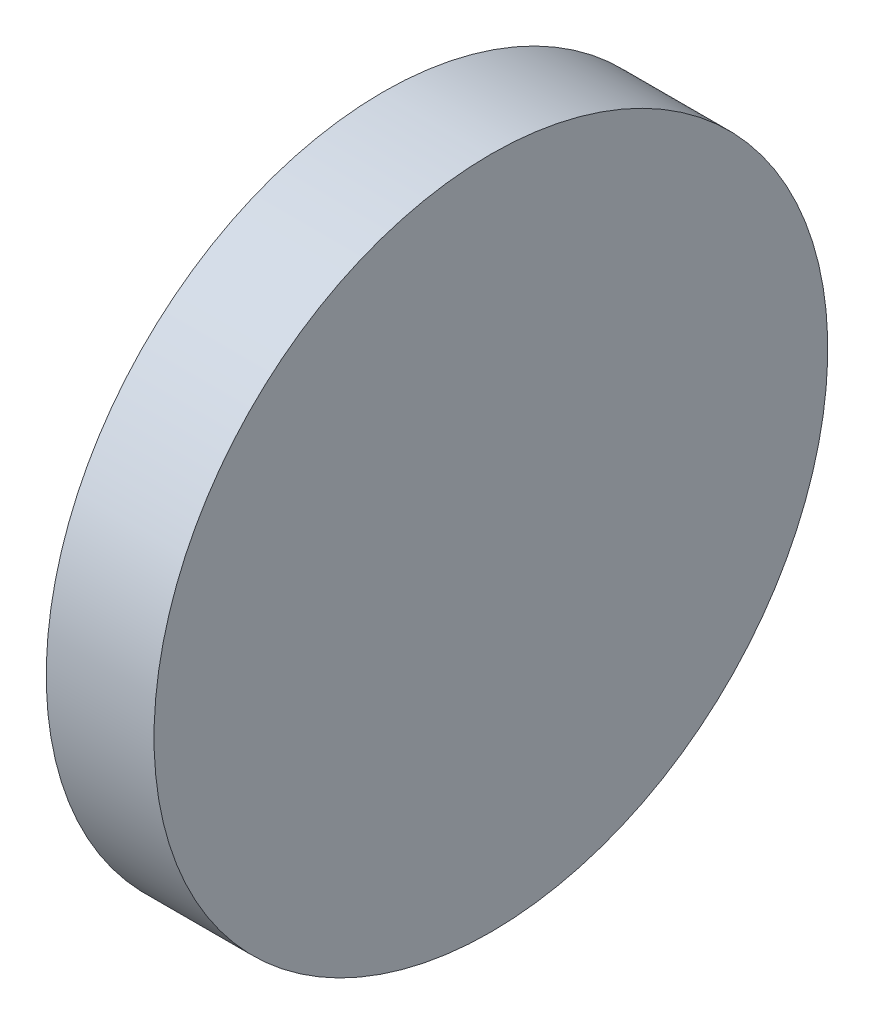
ISO-10303-21;
HEADER;
FILE_DESCRIPTION(('STEP AP214'),'2;1');
FILE_NAME('part.step','',(''),(''),'','','');
FILE_SCHEMA(('AUTOMOTIVE_DESIGN { 1 0 10303 214 1 1 1 1 }'));
ENDSEC;
DATA;
#1=APPLICATION_CONTEXT('core data for automotive mechanical design processes');
#2=APPLICATION_PROTOCOL_DEFINITION('international standard','automotive_design',2000,#1);
#3=PRODUCT_CONTEXT('',#1,'mechanical');
#4=PRODUCT('Part','Part','',(#3));
#5=PRODUCT_RELATED_PRODUCT_CATEGORY('part','',(#4));
#6=PRODUCT_DEFINITION_FORMATION('','',#4);
#7=PRODUCT_DEFINITION_CONTEXT('part definition',#1,'design');
#8=PRODUCT_DEFINITION('design','',#6,#7);
#9=PRODUCT_DEFINITION_SHAPE('','',#8);
#10=(LENGTH_UNIT() NAMED_UNIT(*) SI_UNIT(.MILLI.,.METRE.));
#11=(NAMED_UNIT(*) PLANE_ANGLE_UNIT() SI_UNIT($,.RADIAN.));
#12=(NAMED_UNIT(*) SI_UNIT($,.STERADIAN.) SOLID_ANGLE_UNIT());
#13=UNCERTAINTY_MEASURE_WITH_UNIT(LENGTH_MEASURE(1.E-05),#10,'distance_accuracy_value','');
#14=(GEOMETRIC_REPRESENTATION_CONTEXT(3) GLOBAL_UNCERTAINTY_ASSIGNED_CONTEXT((#13)) GLOBAL_UNIT_ASSIGNED_CONTEXT((#10,
#11,#12)) REPRESENTATION_CONTEXT('',''));
#15=CARTESIAN_POINT('',(0.,0.,0.));
#16=DIRECTION('',(0.,0.,1.));
#17=DIRECTION('',(1.,0.,0.));
#18=AXIS2_PLACEMENT_3D('',#15,#16,#17);
#19=CARTESIAN_POINT('',(1.05963571469062,-0.332340218761648,0.1012));
#20=DIRECTION('',(-1.,0.,0.));
#21=DIRECTION('',(0.,-1.,0.));
#22=AXIS2_PLACEMENT_3D('',#19,#20,#21);
#23=PLANE('',#22);
#24=CARTESIAN_POINT('',(1.05963571469062,-0.332340218761648,0.1012));
#25=DIRECTION('',(1.,0.,0.));
#26=DIRECTION('',(0.,1.,0.));
#27=AXIS2_PLACEMENT_3D('',#24,#25,#26);
#28=CIRCLE('',#27,0.03125);
#29=CARTESIAN_POINT('',(1.05963571469062,-0.301090218761648,0.1012));
#30=VERTEX_POINT('',#29);
#31=EDGE_CURVE('E18',#30,#30,#28,.F.);
#32=ORIENTED_EDGE('',*,*,#31,.F.);
#33=EDGE_LOOP('',(#32));
#34=FACE_BOUND('',#33,.T.);
#35=ADVANCED_FACE('F15',(#34),#23,.F.);
#36=CARTESIAN_POINT('',(1.07963571469062,-0.332340218761648,0.1012));
#37=DIRECTION('',(1.,0.,0.));
#38=DIRECTION('',(0.,1.,0.));
#39=AXIS2_PLACEMENT_3D('',#36,#37,#38);
#40=CYLINDRICAL_SURFACE('',#39,0.03125);
#41=CARTESIAN_POINT('',(1.04963571469062,-0.332340218761648,0.1012));
#42=DIRECTION('',(1.,0.,0.));
#43=DIRECTION('',(0.,1.,0.));
#44=AXIS2_PLACEMENT_3D('',#41,#42,#43);
#45=CIRCLE('',#44,0.03125);
#46=CARTESIAN_POINT('',(1.04963571469062,-0.301090218761648,0.1012));
#47=VERTEX_POINT('',#46);
#48=EDGE_CURVE('E10',#47,#47,#45,.T.);
#49=ORIENTED_EDGE('',*,*,#48,.T.);
#50=EDGE_LOOP('',(#49));
#51=FACE_BOUND('',#50,.T.);
#52=ORIENTED_EDGE('',*,*,#31,.T.);
#53=EDGE_LOOP('',(#52));
#54=FACE_BOUND('',#53,.T.);
#55=ADVANCED_FACE('F27',(#51,#54),#40,.T.);
#56=CARTESIAN_POINT('',(1.04963571469062,-0.332340218761648,0.1012));
#57=DIRECTION('',(1.,0.,0.));
#58=DIRECTION('',(0.,1.,0.));
#59=AXIS2_PLACEMENT_3D('',#56,#57,#58);
#60=PLANE('',#59);
#61=ORIENTED_EDGE('',*,*,#48,.F.);
#62=EDGE_LOOP('',(#61));
#63=FACE_BOUND('',#62,.T.);
#64=ADVANCED_FACE('F34',(#63),#60,.F.);
#65=CLOSED_SHELL('',(#35,#55,#64));
#66=MANIFOLD_SOLID_BREP('B1',#65);
#67=ADVANCED_BREP_SHAPE_REPRESENTATION('',(#18,#66),#14);
#68=SHAPE_DEFINITION_REPRESENTATION(#9,#67);
ENDSEC;
END-ISO-10303-21;
